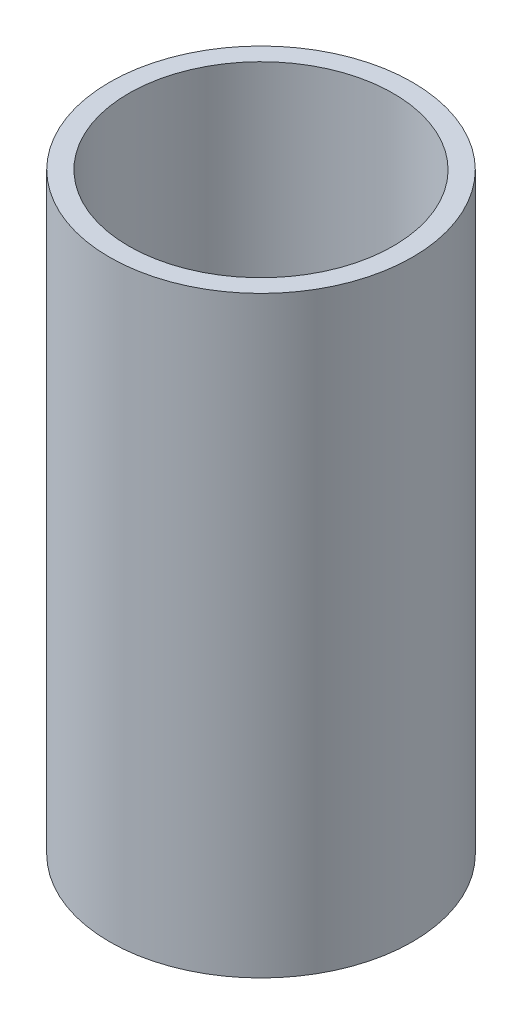
ISO-10303-21;
HEADER;
FILE_DESCRIPTION(('STEP AP214'),'2;1');
FILE_NAME('part.step','',(''),(''),'','','');
FILE_SCHEMA(('AUTOMOTIVE_DESIGN { 1 0 10303 214 1 1 1 1 }'));
ENDSEC;
DATA;
#1=APPLICATION_CONTEXT('core data for automotive mechanical design processes');
#2=APPLICATION_PROTOCOL_DEFINITION('international standard','automotive_design',2000,#1);
#3=PRODUCT_CONTEXT('',#1,'mechanical');
#4=PRODUCT('Part','Part','',(#3));
#5=PRODUCT_RELATED_PRODUCT_CATEGORY('part','',(#4));
#6=PRODUCT_DEFINITION_FORMATION('','',#4);
#7=PRODUCT_DEFINITION_CONTEXT('part definition',#1,'design');
#8=PRODUCT_DEFINITION('design','',#6,#7);
#9=PRODUCT_DEFINITION_SHAPE('','',#8);
#10=(LENGTH_UNIT() NAMED_UNIT(*) SI_UNIT(.MILLI.,.METRE.));
#11=(NAMED_UNIT(*) PLANE_ANGLE_UNIT() SI_UNIT($,.RADIAN.));
#12=(NAMED_UNIT(*) SI_UNIT($,.STERADIAN.) SOLID_ANGLE_UNIT());
#13=UNCERTAINTY_MEASURE_WITH_UNIT(LENGTH_MEASURE(1.E-05),#10,'distance_accuracy_value','');
#14=(GEOMETRIC_REPRESENTATION_CONTEXT(3) GLOBAL_UNCERTAINTY_ASSIGNED_CONTEXT((#13)) GLOBAL_UNIT_ASSIGNED_CONTEXT((#10,
#11,#12)) REPRESENTATION_CONTEXT('',''));
#15=CARTESIAN_POINT('',(0.,0.,0.));
#16=DIRECTION('',(0.,0.,1.));
#17=DIRECTION('',(1.,0.,0.));
#18=AXIS2_PLACEMENT_3D('',#15,#16,#17);
#19=CARTESIAN_POINT('',(0.,136.940976702042,0.));
#20=DIRECTION('',(0.,-1.,0.));
#21=DIRECTION('',(0.,0.,-1.));
#22=AXIS2_PLACEMENT_3D('',#19,#20,#21);
#23=CYLINDRICAL_SURFACE('',#22,35.);
#24=CARTESIAN_POINT('',(0.,136.940976702042,0.));
#25=DIRECTION('',(0.,1.,0.));
#26=DIRECTION('',(0.,0.,1.));
#27=AXIS2_PLACEMENT_3D('',#24,#25,#26);
#28=CIRCLE('',#27,35.);
#29=CARTESIAN_POINT('',(0.,136.940976702042,35.));
#30=VERTEX_POINT('',#29);
#31=EDGE_CURVE('E10',#30,#30,#28,.T.);
#32=ORIENTED_EDGE('',*,*,#31,.F.);
#33=EDGE_LOOP('',(#32));
#34=FACE_BOUND('',#33,.T.);
#35=CARTESIAN_POINT('',(0.,0.,0.));
#36=DIRECTION('',(0.,1.,0.));
#37=DIRECTION('',(0.,0.,1.));
#38=AXIS2_PLACEMENT_3D('',#35,#36,#37);
#39=CIRCLE('',#38,35.);
#40=CARTESIAN_POINT('',(0.,0.,35.));
#41=VERTEX_POINT('',#40);
#42=EDGE_CURVE('E37',#41,#41,#39,.T.);
#43=ORIENTED_EDGE('',*,*,#42,.T.);
#44=EDGE_LOOP('',(#43));
#45=FACE_BOUND('',#44,.T.);
#46=ADVANCED_FACE('F40',(#34,#45),#23,.T.);
#47=CARTESIAN_POINT('',(0.,136.940976702042,0.));
#48=DIRECTION('',(0.,1.,0.));
#49=DIRECTION('',(0.,0.,1.));
#50=AXIS2_PLACEMENT_3D('',#47,#48,#49);
#51=PLANE('',#50);
#52=CARTESIAN_POINT('',(0.,136.940976702042,0.));
#53=DIRECTION('',(0.,1.,0.));
#54=DIRECTION('',(0.,0.,1.));
#55=AXIS2_PLACEMENT_3D('',#52,#53,#54);
#56=CIRCLE('',#55,30.5608161596283);
#57=CARTESIAN_POINT('',(0.,136.940976702042,30.5608161596283));
#58=VERTEX_POINT('',#57);
#59=EDGE_CURVE('E50',#58,#58,#56,.T.);
#60=ORIENTED_EDGE('',*,*,#59,.F.);
#61=EDGE_LOOP('',(#60));
#62=FACE_BOUND('',#61,.T.);
#63=ORIENTED_EDGE('',*,*,#31,.T.);
#64=EDGE_LOOP('',(#63));
#65=FACE_BOUND('',#64,.T.);
#66=ADVANCED_FACE('F59',(#62,#65),#51,.T.);
#67=CARTESIAN_POINT('',(0.,0.,0.));
#68=DIRECTION('',(0.,1.,0.));
#69=DIRECTION('',(0.,0.,1.));
#70=AXIS2_PLACEMENT_3D('',#67,#68,#69);
#71=PLANE('',#70);
#72=CARTESIAN_POINT('',(0.,0.,0.));
#73=DIRECTION('',(0.,1.,0.));
#74=DIRECTION('',(0.,0.,1.));
#75=AXIS2_PLACEMENT_3D('',#72,#73,#74);
#76=CIRCLE('',#75,30.5608161596283);
#77=CARTESIAN_POINT('',(0.,0.,30.5608161596283));
#78=VERTEX_POINT('',#77);
#79=EDGE_CURVE('E47',#78,#78,#76,.T.);
#80=ORIENTED_EDGE('',*,*,#79,.T.);
#81=EDGE_LOOP('',(#80));
#82=FACE_BOUND('',#81,.T.);
#83=ORIENTED_EDGE('',*,*,#42,.F.);
#84=EDGE_LOOP('',(#83));
#85=FACE_BOUND('',#84,.T.);
#86=ADVANCED_FACE('F58',(#82,#85),#71,.F.);
#87=CARTESIAN_POINT('',(0.,136.940976702042,0.));
#88=DIRECTION('',(0.,-1.,0.));
#89=DIRECTION('',(0.,0.,-1.));
#90=AXIS2_PLACEMENT_3D('',#87,#88,#89);
#91=CYLINDRICAL_SURFACE('',#90,30.5608161596283);
#92=ORIENTED_EDGE('',*,*,#59,.T.);
#93=EDGE_LOOP('',(#92));
#94=FACE_BOUND('',#93,.T.);
#95=ORIENTED_EDGE('',*,*,#79,.F.);
#96=EDGE_LOOP('',(#95));
#97=FACE_BOUND('',#96,.T.);
#98=ADVANCED_FACE('F54',(#94,#97),#91,.F.);
#99=CLOSED_SHELL('',(#46,#66,#86,#98));
#100=MANIFOLD_SOLID_BREP('B2',#99);
#101=ADVANCED_BREP_SHAPE_REPRESENTATION('',(#18,#100),#14);
#102=SHAPE_DEFINITION_REPRESENTATION(#9,#101);
ENDSEC;
END-ISO-10303-21;
